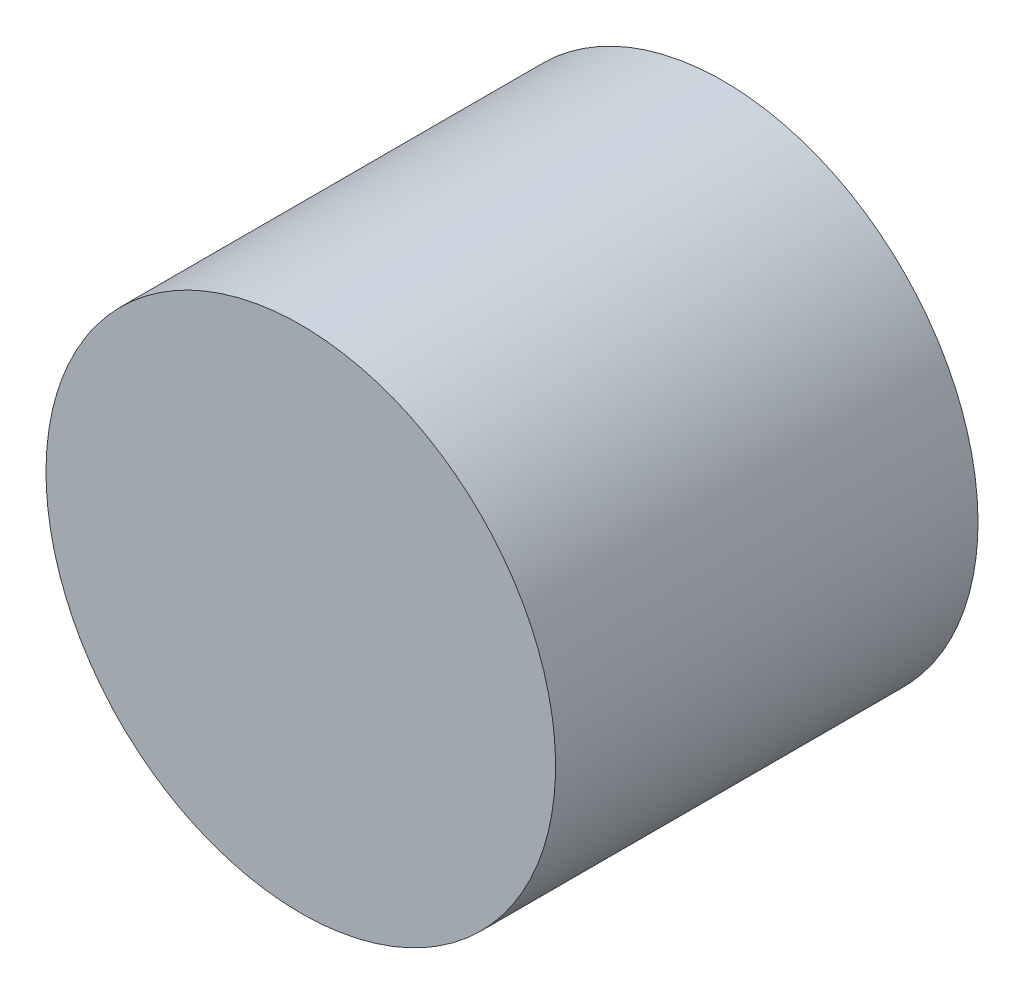
ISO-10303-21;
HEADER;
FILE_DESCRIPTION(('STEP AP214'),'2;1');
FILE_NAME('part.step','',(''),(''),'','','');
FILE_SCHEMA(('AUTOMOTIVE_DESIGN { 1 0 10303 214 1 1 1 1 }'));
ENDSEC;
DATA;
#1=APPLICATION_CONTEXT('core data for automotive mechanical design processes');
#2=APPLICATION_PROTOCOL_DEFINITION('international standard','automotive_design',2000,#1);
#3=PRODUCT_CONTEXT('',#1,'mechanical');
#4=PRODUCT('Part','Part','',(#3));
#5=PRODUCT_RELATED_PRODUCT_CATEGORY('part','',(#4));
#6=PRODUCT_DEFINITION_FORMATION('','',#4);
#7=PRODUCT_DEFINITION_CONTEXT('part definition',#1,'design');
#8=PRODUCT_DEFINITION('design','',#6,#7);
#9=PRODUCT_DEFINITION_SHAPE('','',#8);
#10=(LENGTH_UNIT() NAMED_UNIT(*) SI_UNIT(.MILLI.,.METRE.));
#11=(NAMED_UNIT(*) PLANE_ANGLE_UNIT() SI_UNIT($,.RADIAN.));
#12=(NAMED_UNIT(*) SI_UNIT($,.STERADIAN.) SOLID_ANGLE_UNIT());
#13=UNCERTAINTY_MEASURE_WITH_UNIT(LENGTH_MEASURE(1.E-05),#10,'distance_accuracy_value','');
#14=(GEOMETRIC_REPRESENTATION_CONTEXT(3) GLOBAL_UNCERTAINTY_ASSIGNED_CONTEXT((#13)) GLOBAL_UNIT_ASSIGNED_CONTEXT((#10,
#11,#12)) REPRESENTATION_CONTEXT('',''));
#15=CARTESIAN_POINT('',(0.,0.,0.));
#16=DIRECTION('',(0.,0.,1.));
#17=DIRECTION('',(1.,0.,0.));
#18=AXIS2_PLACEMENT_3D('',#15,#16,#17);
#19=CARTESIAN_POINT('',(1.08724024928659,89.1708449942415,123.808385168912));
#20=CARTESIAN_POINT('',(1.15453224096964,89.1708449942415,123.808385168912));
#21=CARTESIAN_POINT('',(1.28911622433576,89.1976154129842,123.808385168912));
#22=CARTESIAN_POINT('',(1.46025841219395,89.3119689669578,123.808385168912));
#23=CARTESIAN_POINT('',(1.57461196616758,89.4831111548161,123.808385168912));
#24=CARTESIAN_POINT('',(1.61476759428169,89.6849871298652,123.808385168912));
#25=CARTESIAN_POINT('',(1.57461196616758,89.8868631049144,123.808385168912));
#26=CARTESIAN_POINT('',(1.46025841219395,90.0580052927726,123.808385168912));
#27=CARTESIAN_POINT('',(1.28911622433576,90.1723588467462,123.808385168912));
#28=CARTESIAN_POINT('',(1.08724024928659,90.2125144748603,123.808385168912));
#29=CARTESIAN_POINT('',(0.885364274237417,90.1723588467462,123.808385168912));
#30=CARTESIAN_POINT('',(0.714222086379224,90.0580052927725,123.808385168912));
#31=CARTESIAN_POINT('',(0.59986853240559,89.8868631049144,123.808385168912));
#32=CARTESIAN_POINT('',(0.559712904291491,89.6849871298652,123.808385168912));
#33=CARTESIAN_POINT('',(0.59986853240559,89.483111154816,123.808385168912));
#34=CARTESIAN_POINT('',(0.714222086379224,89.3119689669578,123.808385168912));
#35=CARTESIAN_POINT('',(0.885364274237417,89.1976154129842,123.808385168912));
#36=CARTESIAN_POINT('',(1.01994825760353,89.1708449942414,123.808385168912));
#37=CARTESIAN_POINT('',(1.08724024928659,89.1708449942415,123.808385168912));
#38=B_SPLINE_CURVE_WITH_KNOTS('',3,(#19,#20,#21,#22,#23,#24,#25,#26,#27,#28,#29,#30,#31,#32,#33,
#34,#35,#36,#37),.UNSPECIFIED.,.T.,.F.,(4,1,1,1,1,1,1,1,1,1,1,1,1,1,1,1,4),(0.,
0.0625000000000003,0.125000000000001,0.187499999999999,0.25,0.312500000000002,0.374999999999999,
0.4375,0.5,0.562500000000001,0.625000000000001,0.687499999999999,0.75,0.812500000000001,
0.874999999999999,0.9375,1.),.UNSPECIFIED.);
#39=DIRECTION('',(0.,0.,1.));
#40=VECTOR('',#39,1.);
#41=SURFACE_OF_LINEAR_EXTRUSION('',#38,#40);
#42=CARTESIAN_POINT('',(1.08724024928659,89.1708449942415,123.808385168912));
#43=CARTESIAN_POINT('',(1.15453224096964,89.1708449942415,123.808385168912));
#44=CARTESIAN_POINT('',(1.28911622433576,89.1976154129842,123.808385168912));
#45=CARTESIAN_POINT('',(1.46025841219395,89.3119689669578,123.808385168912));
#46=CARTESIAN_POINT('',(1.57461196616758,89.4831111548161,123.808385168912));
#47=CARTESIAN_POINT('',(1.61476759428169,89.6849871298652,123.808385168912));
#48=CARTESIAN_POINT('',(1.57461196616758,89.8868631049144,123.808385168912));
#49=CARTESIAN_POINT('',(1.46025841219395,90.0580052927726,123.808385168912));
#50=CARTESIAN_POINT('',(1.28911622433576,90.1723588467462,123.808385168912));
#51=CARTESIAN_POINT('',(1.08724024928659,90.2125144748603,123.808385168912));
#52=CARTESIAN_POINT('',(0.885364274237417,90.1723588467462,123.808385168912));
#53=CARTESIAN_POINT('',(0.714222086379224,90.0580052927725,123.808385168912));
#54=CARTESIAN_POINT('',(0.59986853240559,89.8868631049144,123.808385168912));
#55=CARTESIAN_POINT('',(0.559712904291491,89.6849871298652,123.808385168912));
#56=CARTESIAN_POINT('',(0.59986853240559,89.483111154816,123.808385168912));
#57=CARTESIAN_POINT('',(0.714222086379224,89.3119689669578,123.808385168912));
#58=CARTESIAN_POINT('',(0.885364274237417,89.1976154129842,123.808385168912));
#59=CARTESIAN_POINT('',(1.01994825760353,89.1708449942414,123.808385168912));
#60=CARTESIAN_POINT('',(1.08724024928659,89.1708449942415,123.808385168912));
#61=B_SPLINE_CURVE_WITH_KNOTS('',3,(#42,#43,#44,#45,#46,#47,#48,#49,#50,#51,#52,#53,#54,#55,#56,
#57,#58,#59,#60),.UNSPECIFIED.,.T.,.F.,(4,1,1,1,1,1,1,1,1,1,1,1,1,1,1,1,4),(0.,
0.0625000000000003,0.125000000000001,0.187499999999999,0.25,0.312500000000002,0.374999999999999,
0.4375,0.5,0.562500000000001,0.625000000000001,0.687499999999999,0.75,0.812500000000001,
0.874999999999999,0.9375,1.),.UNSPECIFIED.);
#62=CARTESIAN_POINT('',(1.08724024928659,89.1708449942415,123.808385168912));
#63=VERTEX_POINT('',#62);
#64=EDGE_CURVE('E9',#63,#63,#61,.T.);
#65=ORIENTED_EDGE('',*,*,#64,.T.);
#66=EDGE_LOOP('',(#65));
#67=FACE_BOUND('',#66,.T.);
#68=CARTESIAN_POINT('',(1.08724024928659,89.1708449942415,124.660837467507));
#69=CARTESIAN_POINT('',(1.07882855185085,89.1708449881518,124.660837467507));
#70=CARTESIAN_POINT('',(1.07041702901024,89.1710541472792,124.660837467507));
#71=CARTESIAN_POINT('',(1.05361399050601,89.171886749041,124.660837467507));
#72=CARTESIAN_POINT('',(1.04522247604859,89.1725102160482,124.660837467507));
#73=CARTESIAN_POINT('',(1.02847953229474,89.1741674425523,124.660837467507));
#74=CARTESIAN_POINT('',(1.02012810578888,89.1752012302047,124.660837467507));
#75=CARTESIAN_POINT('',(1.00348529492743,89.1776751211525,124.660837467507));
#76=CARTESIAN_POINT('',(0.995193913177207,89.1791152419718,124.660837467507));
#77=CARTESIAN_POINT('',(0.978691184813089,89.1823978384694,124.660837467507));
#78=CARTESIAN_POINT('',(0.970479838199196,89.1842403141476,124.660837467507));
#79=CARTESIAN_POINT('',(0.954157165585768,89.1883236666378,124.660837467507));
#80=CARTESIAN_POINT('',(0.946045835287465,89.1905645262628,124.660837467507));
#81=CARTESIAN_POINT('',(0.929943192078108,89.1954406894459,124.660837467507));
#82=CARTESIAN_POINT('',(0.921951870969038,89.1980759659247,124.660837467507));
#83=CARTESIAN_POINT('',(0.90610921606883,89.2037370103375,124.660837467507));
#84=CARTESIAN_POINT('',(0.898257874069983,89.2067627552899,124.660837467507));
#85=CARTESIAN_POINT('',(0.882715270135179,89.2132007126317,124.660837467507));
#86=CARTESIAN_POINT('',(0.875024008199222,89.2166129250212,124.660837467507));
#87=CARTESIAN_POINT('',(0.859818596582596,89.2238124108553,124.660837467507));
#88=CARTESIAN_POINT('',(0.852304457348565,89.2275997063541,124.660837467507));
#89=CARTESIAN_POINT('',(0.837470201136441,89.2355380264536,124.660837467507));
#90=CARTESIAN_POINT('',(0.830150097509469,89.2396890759991,124.660837467507));
#91=CARTESIAN_POINT('',(0.815720858596677,89.2483435824641,124.660837467507));
#92=CARTESIAN_POINT('',(0.808611732424264,89.2528470545766,124.660837467507));
#93=CARTESIAN_POINT('',(0.794621395737194,89.2621950986882,124.660837467507));
#94=CARTESIAN_POINT('',(0.787740185222538,89.2670396706873,124.660837467507));
#95=CARTESIAN_POINT('',(0.774222633161871,89.2770586129492,124.660837467507));
#96=CARTESIAN_POINT('',(0.767586281067081,89.2822329689781,124.660837467507));
#97=CARTESIAN_POINT('',(0.754575405520977,89.2929001710893,124.660837467507));
#98=CARTESIAN_POINT('',(0.748200864132876,89.2983929952907,124.660837467507));
#99=CARTESIAN_POINT('',(0.735730547417637,89.3096858399178,124.660837467507));
#100=CARTESIAN_POINT('',(0.729634755712927,89.3154858422523,124.660837467507));
#101=CARTESIAN_POINT('',(0.717738961673703,89.3273816362915,124.660837467507));
#102=CARTESIAN_POINT('',(0.71193895933919,89.3334774279963,124.660837467507));
#103=CARTESIAN_POINT('',(0.700646114712104,89.3459477447115,124.660837467507));
#104=CARTESIAN_POINT('',(0.695153290510704,89.3523222860996,124.660837467507));
#105=CARTESIAN_POINT('',(0.684486088399523,89.3653331616457,124.660837467507));
#106=CARTESIAN_POINT('',(0.679311732370549,89.3719695137405,124.660837467507));
#107=CARTESIAN_POINT('',(0.669292790108691,89.3854870658012,124.660837467507));
#108=CARTESIAN_POINT('',(0.664448218109533,89.3923682763158,124.660837467507));
#109=CARTESIAN_POINT('',(0.65510017399795,89.4063586130029,124.660837467507));
#110=CARTESIAN_POINT('',(0.650596701885525,89.4134677391752,124.660837467507));
#111=CARTESIAN_POINT('',(0.641942195420448,89.4278969780881,124.660837467507));
#112=CARTESIAN_POINT('',(0.637791145874984,89.4352170817152,124.660837467507));
#113=CARTESIAN_POINT('',(0.629852825775526,89.450051337927,124.660837467507));
#114=CARTESIAN_POINT('',(0.626065530276681,89.4575654771605,124.660837467507));
#115=CARTESIAN_POINT('',(0.618866044442598,89.4727708887786,124.660837467507));
#116=CARTESIAN_POINT('',(0.615453832053265,89.4804621507165,124.660837467507));
#117=CARTESIAN_POINT('',(0.609015874711094,89.4960047546459,124.660837467507));
#118=CARTESIAN_POINT('',(0.605990129758257,89.5038560966374,124.660837467507));
#119=CARTESIAN_POINT('',(0.600329085346729,89.5196987515576,124.660837467507));
#120=CARTESIAN_POINT('',(0.597693808869527,89.527690072694,124.660837467507));
#121=CARTESIAN_POINT('',(0.592817645681904,89.5437927158288,124.660837467507));
#122=CARTESIAN_POINT('',(0.590576786050824,89.5519040460251,124.660837467507));
#123=CARTESIAN_POINT('',(0.586493433577434,89.5682267189171,124.660837467507));
#124=CARTESIAN_POINT('',(0.584650957922216,89.5764380659114,124.660837467507));
#125=CARTESIAN_POINT('',(0.581368361361854,89.5929407932361,124.660837467507));
#126=CARTESIAN_POINT('',(0.579928240456711,89.6012321735663,124.660837467507));
#127=CARTESIAN_POINT('',(0.577454349743244,89.6178749883072,124.660837467507));
#128=CARTESIAN_POINT('',(0.576420562411042,89.6262264201121,124.660837467507));
#129=CARTESIAN_POINT('',(0.574763335032322,89.642969349389,124.660837467507));
#130=CARTESIAN_POINT('',(0.574139866830513,89.6513608440721,124.660837467507));
#131=CARTESIAN_POINT('',(0.573307268332321,89.6681639365997,124.660837467507));
#132=CARTESIAN_POINT('',(0.573098113662858,89.6765755332325,124.660837467507));
#133=CARTESIAN_POINT('',(0.573098113662858,89.6933987264979,124.660837467507));
#134=CARTESIAN_POINT('',(0.573307268332322,89.7018103231307,124.660837467507));
#135=CARTESIAN_POINT('',(0.574139866830513,89.7186134156583,124.660837467507));
#136=CARTESIAN_POINT('',(0.574763335032322,89.7270049103414,124.660837467507));
#137=CARTESIAN_POINT('',(0.576420562411042,89.7437478396184,124.660837467507));
#138=CARTESIAN_POINT('',(0.577454349743244,89.7520992714233,124.660837467507));
#139=CARTESIAN_POINT('',(0.579928240456711,89.7687420861641,124.660837467507));
#140=CARTESIAN_POINT('',(0.581368361361855,89.7770334664943,124.660837467507));
#141=CARTESIAN_POINT('',(0.584650957922216,89.793536193819,124.660837467507));
#142=CARTESIAN_POINT('',(0.586493433577434,89.8017475408133,124.660837467507));
#143=CARTESIAN_POINT('',(0.590576786050824,89.8180702137053,124.660837467507));
#144=CARTESIAN_POINT('',(0.592817645681904,89.8261815439016,124.660837467507));
#145=CARTESIAN_POINT('',(0.597693808869528,89.8422841870364,124.660837467507));
#146=CARTESIAN_POINT('',(0.600329085346729,89.8502755081727,124.660837467507));
#147=CARTESIAN_POINT('',(0.605990129758258,89.8661181630929,124.660837467507));
#148=CARTESIAN_POINT('',(0.609015874711095,89.8739695050845,124.660837467507));
#149=CARTESIAN_POINT('',(0.615453832053264,89.8895121090139,124.660837467507));
#150=CARTESIAN_POINT('',(0.618866044442595,89.8972033709519,124.660837467507));
#151=CARTESIAN_POINT('',(0.626065530276679,89.9124087825699,124.660837467507));
#152=CARTESIAN_POINT('',(0.629852825775528,89.9199229218034,124.660837467507));
#153=CARTESIAN_POINT('',(0.637791145874986,89.9347571780151,124.660837467507));
#154=CARTESIAN_POINT('',(0.641942195420448,89.9420772816423,124.660837467507));
#155=CARTESIAN_POINT('',(0.650596701885525,89.9565065205552,124.660837467507));
#156=CARTESIAN_POINT('',(0.655100173997953,89.9636156467275,124.660837467507));
#157=CARTESIAN_POINT('',(0.664448218109535,89.9776059834146,124.660837467507));
#158=CARTESIAN_POINT('',(0.66929279010869,89.9844871939293,124.660837467507));
#159=CARTESIAN_POINT('',(0.679311732370546,89.9980047459899,124.660837467507));
#160=CARTESIAN_POINT('',(0.684486088399521,90.0046410980847,124.660837467507));
#161=CARTESIAN_POINT('',(0.695153290510704,90.0176519736308,124.660837467507));
#162=CARTESIAN_POINT('',(0.700646114712103,90.0240265150189,124.660837467507));
#163=CARTESIAN_POINT('',(0.711938959339191,90.0364968317341,124.660837467507));
#164=CARTESIAN_POINT('',(0.717738961673707,90.0425926234388,124.660837467507));
#165=CARTESIAN_POINT('',(0.729634755712928,90.0544884174781,124.660837467507));
#166=CARTESIAN_POINT('',(0.735730547417634,90.0602884198126,124.660837467507));
#167=CARTESIAN_POINT('',(0.748200864132874,90.0715812644397,124.660837467507));
#168=CARTESIAN_POINT('',(0.75457540552098,90.0770740886411,124.660837467507));
#169=CARTESIAN_POINT('',(0.767586281067083,90.0877412907522,124.660837467507));
#170=CARTESIAN_POINT('',(0.774222633161867,90.0929156467812,124.660837467507));
#171=CARTESIAN_POINT('',(0.78774018522254,90.1029345890431,124.660837467507));
#172=CARTESIAN_POINT('',(0.794621395737208,90.1077791610422,124.660837467507));
#173=CARTESIAN_POINT('',(0.808611732424251,90.1171272051538,124.660837467507));
#174=CARTESIAN_POINT('',(0.815720858596626,90.1216306772663,124.660837467507));
#175=CARTESIAN_POINT('',(0.830150097509521,90.1302851837314,124.660837467507));
#176=CARTESIAN_POINT('',(0.837470201136636,90.1344362332768,124.660837467507));
#177=CARTESIAN_POINT('',(0.852304457348374,90.1423745533763,124.660837467507));
#178=CARTESIAN_POINT('',(0.859818596581877,90.1461618488751,124.660837467507));
#179=CARTESIAN_POINT('',(0.87502400819994,90.1533613347092,124.660837467507));
#180=CARTESIAN_POINT('',(0.882715270137861,90.1567735470985,124.660837467507));
#181=CARTESIAN_POINT('',(0.898257874067307,90.1632115044407,124.660837467507));
#182=CARTESIAN_POINT('',(0.906109216058832,90.1662372493936,124.660837467507));
#183=CARTESIAN_POINT('',(0.921951870979033,90.1718982938051,124.660837467507));
#184=CARTESIAN_POINT('',(0.92994319211542,90.1745335702823,124.660837467507));
#185=CARTESIAN_POINT('',(0.946045835250156,90.1794097334699,124.660837467507));
#186=CARTESIAN_POINT('',(0.954157165446513,90.181650593101,124.660837467507));
#187=CARTESIAN_POINT('',(0.970479838338459,90.1857339455744,124.660837467507));
#188=CARTESIAN_POINT('',(0.978691185332838,90.1875764212296,124.660837467507));
#189=CARTESIAN_POINT('',(0.99519391265746,90.1908590177899,124.660837467507));
#190=CARTESIAN_POINT('',(1.0034852929877,90.1922991386951,124.660837467507));
#191=CARTESIAN_POINT('',(1.02012810772852,90.1947730294085,124.660837467507));
#192=CARTESIAN_POINT('',(1.02847953953345,90.1958068167407,124.660837467507));
#193=CARTESIAN_POINT('',(1.04522246881038,90.1974640441195,124.660837467507));
#194=CARTESIAN_POINT('',(1.05361396349353,90.1980875123213,124.660837467507));
#195=CARTESIAN_POINT('',(1.07041705602112,90.1989201108195,124.660837467507));
#196=CARTESIAN_POINT('',(1.07882865265386,90.1991292654889,124.660837467507));
#197=CARTESIAN_POINT('',(1.09565184591932,90.1991292654889,124.660837467507));
#198=CARTESIAN_POINT('',(1.10406344255205,90.1989201108195,124.660837467507));
#199=CARTESIAN_POINT('',(1.12086653507964,90.1980875123213,124.660837467507));
#200=CARTESIAN_POINT('',(1.1292580297628,90.1974640441195,124.660837467507));
#201=CARTESIAN_POINT('',(1.14600095903973,90.1958068167408,124.660837467507));
#202=CARTESIAN_POINT('',(1.15435239084465,90.1947730294085,124.660837467507));
#203=CARTESIAN_POINT('',(1.17099520558547,90.1922991386951,124.660837467507));
#204=CARTESIAN_POINT('',(1.17928658591572,90.1908590177899,124.660837467507));
#205=CARTESIAN_POINT('',(1.19578931324034,90.1875764212296,124.660837467507));
#206=CARTESIAN_POINT('',(1.20400066023472,90.1857339455743,124.660837467507));
#207=CARTESIAN_POINT('',(1.22032333312666,90.1816505931009,124.660837467507));
#208=CARTESIAN_POINT('',(1.22843466332302,90.1794097334699,124.660837467507));
#209=CARTESIAN_POINT('',(1.24453730645776,90.1745335702823,124.660837467507));
#210=CARTESIAN_POINT('',(1.25252862759414,90.1718982938051,124.660837467507));
#211=CARTESIAN_POINT('',(1.26837128251434,90.1662372493935,124.660837467507));
#212=CARTESIAN_POINT('',(1.27622262450587,90.1632115044407,124.660837467507));
#213=CARTESIAN_POINT('',(1.29176522843532,90.1567735470985,124.660837467507));
#214=CARTESIAN_POINT('',(1.29945649037324,90.1533613347092,124.660837467507));
#215=CARTESIAN_POINT('',(1.3146619019913,90.1461618488751,124.660837467507));
#216=CARTESIAN_POINT('',(1.3221760412248,90.1423745533763,124.660837467507));
#217=CARTESIAN_POINT('',(1.33701029743654,90.1344362332768,124.660837467507));
#218=CARTESIAN_POINT('',(1.34433040106365,90.1302851837313,124.660837467507));
#219=CARTESIAN_POINT('',(1.35875963997655,90.1216306772663,124.660837467507));
#220=CARTESIAN_POINT('',(1.36586876614893,90.1171272051538,124.660837467507));
#221=CARTESIAN_POINT('',(1.37985910283597,90.1077791610422,124.660837467507));
#222=CARTESIAN_POINT('',(1.38674031335064,90.1029345890431,124.660837467507));
#223=CARTESIAN_POINT('',(1.40025786541131,90.0929156467812,124.660837467507));
#224=CARTESIAN_POINT('',(1.4068942175061,90.0877412907523,124.660837467507));
#225=CARTESIAN_POINT('',(1.4199050930522,90.0770740886411,124.660837467507));
#226=CARTESIAN_POINT('',(1.4262796344403,90.0715812644397,124.660837467507));
#227=CARTESIAN_POINT('',(1.43874995115554,90.0602884198126,124.660837467507));
#228=CARTESIAN_POINT('',(1.44484574286025,90.0544884174781,124.660837467507));
#229=CARTESIAN_POINT('',(1.45674153689947,90.0425926234389,124.660837467507));
#230=CARTESIAN_POINT('',(1.46254153923399,90.0364968317342,124.660837467507));
#231=CARTESIAN_POINT('',(1.47383438386108,90.0240265150189,124.660837467507));
#232=CARTESIAN_POINT('',(1.47932720806247,90.0176519736308,124.660837467507));
#233=CARTESIAN_POINT('',(1.48999441017365,90.0046410980847,124.660837467507));
#234=CARTESIAN_POINT('',(1.49516876620263,89.9980047459899,124.660837467507));
#235=CARTESIAN_POINT('',(1.50518770846449,89.9844871939293,124.660837467507));
#236=CARTESIAN_POINT('',(1.51003228046364,89.9776059834146,124.660837467507));
#237=CARTESIAN_POINT('',(1.51938032457522,89.9636156467276,124.660837467507));
#238=CARTESIAN_POINT('',(1.52388379668765,89.9565065205552,124.660837467507));
#239=CARTESIAN_POINT('',(1.53253830315273,89.9420772816423,124.660837467507));
#240=CARTESIAN_POINT('',(1.53668935269819,89.9347571780152,124.660837467507));
#241=CARTESIAN_POINT('',(1.54462767279765,89.9199229218034,124.660837467507));
#242=CARTESIAN_POINT('',(1.5484149682965,89.9124087825699,124.660837467507));
#243=CARTESIAN_POINT('',(1.55561445413058,89.8972033709519,124.660837467507));
#244=CARTESIAN_POINT('',(1.55902666651991,89.8895121090139,124.660837467507));
#245=CARTESIAN_POINT('',(1.56546462386208,89.8739695050845,124.660837467507));
#246=CARTESIAN_POINT('',(1.56849036881492,89.866118163093,124.660837467507));
#247=CARTESIAN_POINT('',(1.57415141322645,89.8502755081728,124.660837467507));
#248=CARTESIAN_POINT('',(1.57678668970365,89.8422841870364,124.660837467507));
#249=CARTESIAN_POINT('',(1.58166285289127,89.8261815439017,124.660837467507));
#250=CARTESIAN_POINT('',(1.58390371252235,89.8180702137053,124.660837467507));
#251=CARTESIAN_POINT('',(1.58798706499574,89.8017475408134,124.660837467507));
#252=CARTESIAN_POINT('',(1.58982954065096,89.793536193819,124.660837467507));
#253=CARTESIAN_POINT('',(1.59311213721132,89.7770334664943,124.660837467507));
#254=CARTESIAN_POINT('',(1.59455225811647,89.7687420861641,124.660837467507));
#255=CARTESIAN_POINT('',(1.59702614882993,89.7520992714233,124.660837467507));
#256=CARTESIAN_POINT('',(1.59805993616214,89.7437478396184,124.660837467507));
#257=CARTESIAN_POINT('',(1.59971716354086,89.7270049103414,124.660837467507));
#258=CARTESIAN_POINT('',(1.60034063174266,89.7186134156583,124.660837467507));
#259=CARTESIAN_POINT('',(1.60117323024085,89.7018103231307,124.660837467507));
#260=CARTESIAN_POINT('',(1.60138238491032,89.6933987264979,124.660837467507));
#261=CARTESIAN_POINT('',(1.60138238491032,89.6765755332325,124.660837467507));
#262=CARTESIAN_POINT('',(1.60117323024086,89.6681639365997,124.660837467507));
#263=CARTESIAN_POINT('',(1.60034063174266,89.6513608440721,124.660837467507));
#264=CARTESIAN_POINT('',(1.59971716354086,89.642969349389,124.660837467507));
#265=CARTESIAN_POINT('',(1.59805993616214,89.6262264201121,124.660837467507));
#266=CARTESIAN_POINT('',(1.59702614882993,89.6178749883072,124.660837467507));
#267=CARTESIAN_POINT('',(1.59455225811647,89.6012321735663,124.660837467507));
#268=CARTESIAN_POINT('',(1.59311213721132,89.5929407932361,124.660837467507));
#269=CARTESIAN_POINT('',(1.58982954065096,89.5764380659115,124.660837467507));
#270=CARTESIAN_POINT('',(1.58798706499574,89.5682267189171,124.660837467507));
#271=CARTESIAN_POINT('',(1.58390371252235,89.5519040460251,124.660837467507));
#272=CARTESIAN_POINT('',(1.58166285289127,89.5437927158288,124.660837467507));
#273=CARTESIAN_POINT('',(1.57678668970365,89.5276900726941,124.660837467507));
#274=CARTESIAN_POINT('',(1.57415141322645,89.5196987515577,124.660837467507));
#275=CARTESIAN_POINT('',(1.56849036881492,89.5038560966375,124.660837467507));
#276=CARTESIAN_POINT('',(1.56546462386208,89.4960047546459,124.660837467507));
#277=CARTESIAN_POINT('',(1.55902666651991,89.4804621507165,124.660837467507));
#278=CARTESIAN_POINT('',(1.55561445413058,89.4727708887786,124.660837467507));
#279=CARTESIAN_POINT('',(1.54841496829649,89.4575654771605,124.660837467507));
#280=CARTESIAN_POINT('',(1.54462767279765,89.450051337927,124.660837467507));
#281=CARTESIAN_POINT('',(1.53668935269819,89.4352170817153,124.660837467507));
#282=CARTESIAN_POINT('',(1.53253830315273,89.4278969780882,124.660837467507));
#283=CARTESIAN_POINT('',(1.52388379668765,89.4134677391753,124.660837467507));
#284=CARTESIAN_POINT('',(1.51938032457522,89.4063586130029,124.660837467507));
#285=CARTESIAN_POINT('',(1.51003228046364,89.3923682763158,124.660837467507));
#286=CARTESIAN_POINT('',(1.50518770846449,89.3854870658012,124.660837467507));
#287=CARTESIAN_POINT('',(1.49516876620263,89.3719695137405,124.660837467507));
#288=CARTESIAN_POINT('',(1.48999441017365,89.3653331616457,124.660837467507));
#289=CARTESIAN_POINT('',(1.47932720806247,89.3523222860996,124.660837467507));
#290=CARTESIAN_POINT('',(1.47383438386107,89.3459477447115,124.660837467507));
#291=CARTESIAN_POINT('',(1.46254153923399,89.3334774279962,124.660837467507));
#292=CARTESIAN_POINT('',(1.45674153689947,89.3273816362915,124.660837467507));
#293=CARTESIAN_POINT('',(1.44484574286025,89.3154858422523,124.660837467507));
#294=CARTESIAN_POINT('',(1.43874995115554,89.3096858399178,124.660837467507));
#295=CARTESIAN_POINT('',(1.4262796344403,89.2983929952907,124.660837467507));
#296=CARTESIAN_POINT('',(1.4199050930522,89.2929001710893,124.660837467507));
#297=CARTESIAN_POINT('',(1.40689421750609,89.2822329689781,124.660837467507));
#298=CARTESIAN_POINT('',(1.4002578654113,89.2770586129492,124.660837467507));
#299=CARTESIAN_POINT('',(1.38674031335064,89.2670396706873,124.660837467507));
#300=CARTESIAN_POINT('',(1.37985910283598,89.2621950986882,124.660837467507));
#301=CARTESIAN_POINT('',(1.36586876614891,89.2528470545766,124.660837467507));
#302=CARTESIAN_POINT('',(1.3587596399765,89.2483435824641,124.660837467507));
#303=CARTESIAN_POINT('',(1.34433040106371,89.2396890759991,124.660837467507));
#304=CARTESIAN_POINT('',(1.33701029743673,89.2355380264536,124.660837467507));
#305=CARTESIAN_POINT('',(1.32217604122461,89.2275997063541,124.660837467507));
#306=CARTESIAN_POINT('',(1.31466190199058,89.2238124108553,124.660837467507));
#307=CARTESIAN_POINT('',(1.29945649037395,89.2166129250212,124.660837467507));
#308=CARTESIAN_POINT('',(1.291765228438,89.2132007126317,124.660837467507));
#309=CARTESIAN_POINT('',(1.27622262450319,89.2067627552899,124.660837467507));
#310=CARTESIAN_POINT('',(1.26837128250435,89.2037370103375,124.660837467507));
#311=CARTESIAN_POINT('',(1.25252862760414,89.1980759659247,124.660837467507));
#312=CARTESIAN_POINT('',(1.24453730649507,89.1954406894459,124.660837467507));
#313=CARTESIAN_POINT('',(1.22843466328571,89.1905645262628,124.660837467507));
#314=CARTESIAN_POINT('',(1.22032333298741,89.1883236666379,124.660837467507));
#315=CARTESIAN_POINT('',(1.20400066037398,89.1842403141476,124.660837467507));
#316=CARTESIAN_POINT('',(1.19578931376008,89.1823978384694,124.660837467507));
#317=CARTESIAN_POINT('',(1.17928658539597,89.1791152419719,124.660837467507));
#318=CARTESIAN_POINT('',(1.17099520364574,89.1776751211525,124.660837467507));
#319=CARTESIAN_POINT('',(1.1543523927843,89.1752012302046,124.660837467507));
#320=CARTESIAN_POINT('',(1.14600096627844,89.1741674425523,124.660837467507));
#321=CARTESIAN_POINT('',(1.12925802252459,89.1725102160482,124.660837467507));
#322=CARTESIAN_POINT('',(1.12086650806717,89.171886749041,124.660837467507));
#323=CARTESIAN_POINT('',(1.10406346956294,89.1710541472791,124.660837467507));
#324=CARTESIAN_POINT('',(1.09565194672233,89.1708449881518,124.660837467507));
#325=CARTESIAN_POINT('',(1.08724024928659,89.1708449942415,124.660837467507));
#326=B_SPLINE_CURVE_WITH_KNOTS('',3,(#68,#69,#70,#71,#72,#73,#74,#75,#76,#77,#78,#79,#80,#81,
#82,#83,#84,#85,#86,#87,#88,#89,#90,#91,#92,#93,#94,#95,#96,#97,#98,#99,#100,#101,#102,#103,
#104,#105,#106,#107,#108,#109,#110,#111,#112,#113,#114,#115,#116,#117,#118,#119,#120,#121,#122,
#123,#124,#125,#126,#127,#128,#129,#130,#131,#132,#133,#134,#135,#136,#137,#138,#139,#140,#141,
#142,#143,#144,#145,#146,#147,#148,#149,#150,#151,#152,#153,#154,#155,#156,#157,#158,#159,#160,
#161,#162,#163,#164,#165,#166,#167,#168,#169,#170,#171,#172,#173,#174,#175,#176,#177,#178,#179,
#180,#181,#182,#183,#184,#185,#186,#187,#188,#189,#190,#191,#192,#193,#194,#195,#196,#197,#198,
#199,#200,#201,#202,#203,#204,#205,#206,#207,#208,#209,#210,#211,#212,#213,#214,#215,#216,#217,
#218,#219,#220,#221,#222,#223,#224,#225,#226,#227,#228,#229,#230,#231,#232,#233,#234,#235,#236,
#237,#238,#239,#240,#241,#242,#243,#244,#245,#246,#247,#248,#249,#250,#251,#252,#253,#254,#255,
#256,#257,#258,#259,#260,#261,#262,#263,#264,#265,#266,#267,#268,#269,#270,#271,#272,#273,#274,
#275,#276,#277,#278,#279,#280,#281,#282,#283,#284,#285,#286,#287,#288,#289,#290,#291,#292,#293,
#294,#295,#296,#297,#298,#299,#300,#301,#302,#303,#304,#305,#306,#307,#308,#309,#310,#311,#312,
#313,#314,#315,#316,#317,#318,#319,#320,#321,#322,#323,#324,#325),.UNSPECIFIED.,.F.,.F.,(4,2,2,
2,2,2,2,2,2,2,2,2,2,2,2,2,2,2,2,2,2,2,2,2,2,2,2,2,2,2,2,2,2,2,2,2,2,2,2,2,2,2,2,2,2,2,2,2,2,2,2,
2,2,2,2,2,2,2,2,2,2,2,2,2,2,2,2,2,2,2,2,2,2,2,2,2,2,2,2,2,2,2,2,2,2,2,2,2,2,2,2,2,2,2,2,2,2,2,2,
2,2,2,2,2,2,2,2,2,2,2,2,2,2,2,2,2,2,2,2,2,2,2,2,2,2,2,2,2,4),(0.,0.0252322451196313,
0.0504659747238355,0.0757014361163392,0.100937986000661,0.126174535884985,0.151409997277487,
0.176643726881697,0.201875972001326,0.227108217120956,0.252341946725162,0.277577408117661,
0.302813958001991,0.328050507886316,0.353285969278812,0.378519698883021,0.403751944002649,
0.428984189122294,0.4542179187265,0.479453380119004,0.504689930003317,0.529926479887632,
0.555161941280131,0.580395670884349,0.605627916003978,0.630860161123602,0.656093890727795,
0.681329352120309,0.706565902004634,0.731802451888965,0.757037913281467,0.782271642885644,
0.807503888005292,0.83273613312494,0.857969862729145,0.883205324121647,0.908441874005964,
0.93367842389029,0.958913885282789,0.984147614886983,1.00937986000662,1.03461210512626,
1.05984583473045,1.08508129612295,1.11031784600727,1.1355543958916,1.16078985728411,
1.1860235868883,1.21125583200794,1.23648807712758,1.26172180673178,1.28695726812428,
1.31219381800861,1.33743036789294,1.36266582928543,1.38789955888965,1.41313180400927,
1.43836404912891,1.46359777873311,1.48883324012561,1.51406979000994,1.53930633989426,
1.56454180128676,1.58977553089096,1.6150077760106,1.64024002113023,1.66547375073443,
1.69070921212694,1.71594576201126,1.74118231189558,1.76641777328809,1.79165150289229,
1.81688374801192,1.84211599313155,1.86734972273576,1.89258518412826,1.91782173401258,
1.94305828389691,1.9682937452894,1.9935274748936,2.01875972001323,2.04399196513286,
2.06922569473708,2.09446115612956,2.11969770601389,2.14493425589821,2.17016971729071,
2.19540344689492,2.22063569201456,2.2458679371342,2.2711016667384,2.29633712813089,
2.32157367801523,2.34681022789955,2.37204568929205,2.39727941889625,2.42251166401589,
2.44774390913552,2.47297763873973,2.49821310013221,2.52344965001655,2.54868619990086,
2.57392166129337,2.59915539089756,2.6243876360172,2.64961988113683,2.67485361074105,
2.70008907213354,2.72532562201786,2.7505621719022,2.77579763329469,2.80103136289891,
2.82626360801854,2.85149585313818,2.87672958274238,2.90196504413488,2.9272015940192,
2.95243814390353,2.97767360529603,3.00290733490024,3.02813958001986,3.05337182513949,
3.0786055547437,3.1038410161362,3.12907756602052,3.15431411590485,3.17954957729735,
3.20478330690156,3.23001555202119),.UNSPECIFIED.);
#327=CARTESIAN_POINT('',(1.08724024928659,89.1708449942415,124.660837467507));
#328=VERTEX_POINT('',#327);
#329=EDGE_CURVE('E24',#328,#328,#326,.F.);
#330=ORIENTED_EDGE('',*,*,#329,.F.);
#331=EDGE_LOOP('',(#330));
#332=FACE_BOUND('',#331,.T.);
#333=ADVANCED_FACE('F14',(#67,#332),#41,.T.);
#334=CARTESIAN_POINT('',(16.7615136437524,68.1112006131999,123.808385168912));
#335=DIRECTION('',(0.,0.,1.));
#336=DIRECTION('',(0.,-1.,0.));
#337=AXIS2_PLACEMENT_3D('',#334,#335,#336);
#338=PLANE('',#337);
#339=ORIENTED_EDGE('',*,*,#64,.F.);
#340=EDGE_LOOP('',(#339));
#341=FACE_BOUND('',#340,.T.);
#342=ADVANCED_FACE('F62',(#341),#338,.F.);
#343=CARTESIAN_POINT('',(16.7615136437524,68.1112006131999,124.660837467507));
#344=DIRECTION('',(0.,0.,1.));
#345=DIRECTION('',(0.,-1.,0.));
#346=AXIS2_PLACEMENT_3D('',#343,#344,#345);
#347=PLANE('',#346);
#348=ORIENTED_EDGE('',*,*,#329,.T.);
#349=EDGE_LOOP('',(#348));
#350=FACE_BOUND('',#349,.T.);
#351=ADVANCED_FACE('F31',(#350),#347,.T.);
#352=CLOSED_SHELL('',(#333,#342,#351));
#353=MANIFOLD_SOLID_BREP('B1',#352);
#354=ADVANCED_BREP_SHAPE_REPRESENTATION('',(#18,#353),#14);
#355=SHAPE_DEFINITION_REPRESENTATION(#9,#354);
ENDSEC;
END-ISO-10303-21;
